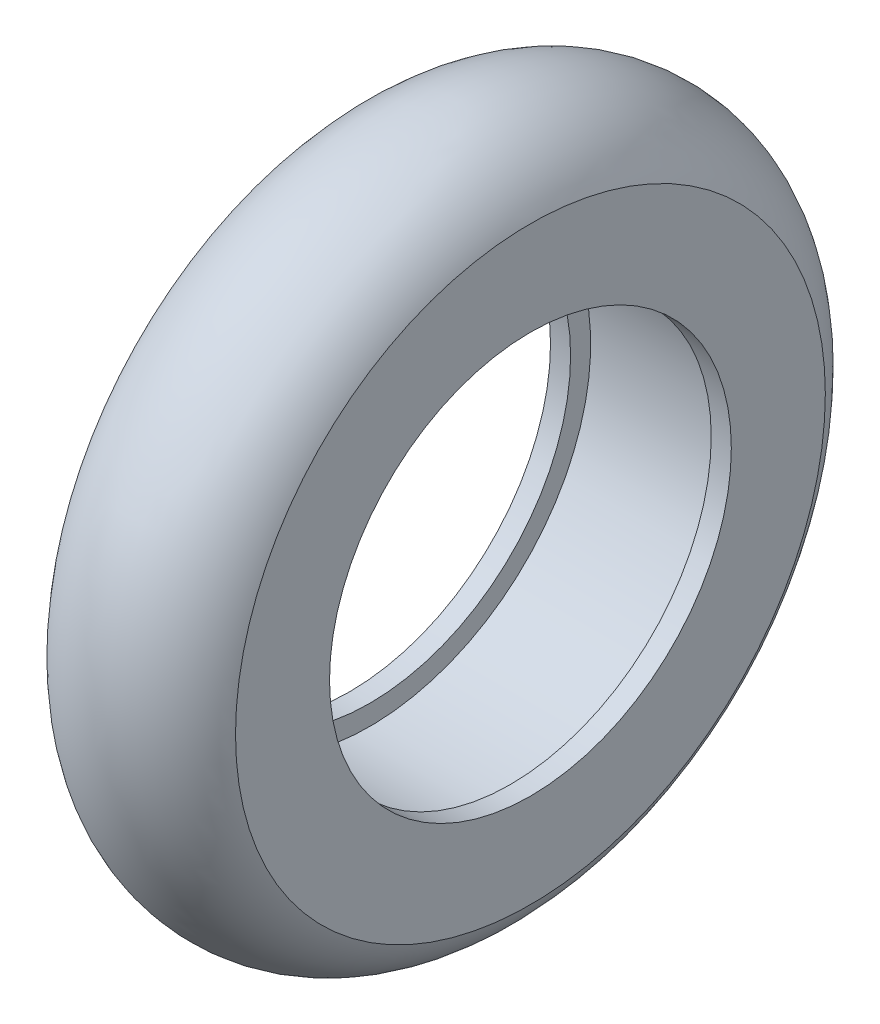
ISO-10303-21;
HEADER;
FILE_DESCRIPTION(('STEP AP214'),'2;1');
FILE_NAME('part.step','',(''),(''),'','','');
FILE_SCHEMA(('AUTOMOTIVE_DESIGN { 1 0 10303 214 1 1 1 1 }'));
ENDSEC;
DATA;
#1=APPLICATION_CONTEXT('core data for automotive mechanical design processes');
#2=APPLICATION_PROTOCOL_DEFINITION('international standard','automotive_design',2000,#1);
#3=PRODUCT_CONTEXT('',#1,'mechanical');
#4=PRODUCT('Part','Part','',(#3));
#5=PRODUCT_RELATED_PRODUCT_CATEGORY('part','',(#4));
#6=PRODUCT_DEFINITION_FORMATION('','',#4);
#7=PRODUCT_DEFINITION_CONTEXT('part definition',#1,'design');
#8=PRODUCT_DEFINITION('design','',#6,#7);
#9=PRODUCT_DEFINITION_SHAPE('','',#8);
#10=(LENGTH_UNIT() NAMED_UNIT(*) SI_UNIT(.MILLI.,.METRE.));
#11=(NAMED_UNIT(*) PLANE_ANGLE_UNIT() SI_UNIT($,.RADIAN.));
#12=(NAMED_UNIT(*) SI_UNIT($,.STERADIAN.) SOLID_ANGLE_UNIT());
#13=UNCERTAINTY_MEASURE_WITH_UNIT(LENGTH_MEASURE(1.E-05),#10,'distance_accuracy_value','');
#14=(GEOMETRIC_REPRESENTATION_CONTEXT(3) GLOBAL_UNCERTAINTY_ASSIGNED_CONTEXT((#13)) GLOBAL_UNIT_ASSIGNED_CONTEXT((#10,
#11,#12)) REPRESENTATION_CONTEXT('',''));
#15=CARTESIAN_POINT('',(0.,0.,0.));
#16=DIRECTION('',(0.,0.,1.));
#17=DIRECTION('',(1.,0.,0.));
#18=AXIS2_PLACEMENT_3D('',#15,#16,#17);
#19=CARTESIAN_POINT('',(-8.,11.,0.));
#20=DIRECTION('',(-1.,0.,0.));
#21=DIRECTION('',(0.,0.,1.));
#22=AXIS2_PLACEMENT_3D('',#19,#20,#21);
#23=PLANE('',#22);
#24=CARTESIAN_POINT('',(-8.,0.,0.));
#25=DIRECTION('',(-1.,0.,0.));
#26=DIRECTION('',(0.,0.,1.));
#27=AXIS2_PLACEMENT_3D('',#24,#25,#26);
#28=CIRCLE('',#27,11.);
#29=CARTESIAN_POINT('',(-8.,0.,11.));
#30=VERTEX_POINT('',#29);
#31=EDGE_CURVE('E10',#30,#30,#28,.T.);
#32=ORIENTED_EDGE('',*,*,#31,.F.);
#33=EDGE_LOOP('',(#32));
#34=FACE_BOUND('',#33,.T.);
#35=CARTESIAN_POINT('',(-8.,0.,0.));
#36=DIRECTION('',(-1.,0.,0.));
#37=DIRECTION('',(0.,0.,1.));
#38=AXIS2_PLACEMENT_3D('',#35,#36,#37);
#39=CIRCLE('',#38,10.);
#40=CARTESIAN_POINT('',(-8.,0.,10.));
#41=VERTEX_POINT('',#40);
#42=EDGE_CURVE('E71',#41,#41,#39,.T.);
#43=ORIENTED_EDGE('',*,*,#42,.T.);
#44=EDGE_LOOP('',(#43));
#45=FACE_BOUND('',#44,.T.);
#46=ADVANCED_FACE('F43',(#34,#45),#23,.F.);
#47=CARTESIAN_POINT('',(-9.,0.,0.));
#48=DIRECTION('',(-1.,0.,0.));
#49=DIRECTION('',(0.,0.,1.));
#50=AXIS2_PLACEMENT_3D('',#47,#48,#49);
#51=CYLINDRICAL_SURFACE('',#50,11.);
#52=CARTESIAN_POINT('',(-0.999999999999999,0.,0.));
#53=DIRECTION('',(-1.,0.,0.));
#54=DIRECTION('',(0.,0.,1.));
#55=AXIS2_PLACEMENT_3D('',#52,#53,#54);
#56=CIRCLE('',#55,11.);
#57=CARTESIAN_POINT('',(-0.999999999999999,0.,11.));
#58=VERTEX_POINT('',#57);
#59=EDGE_CURVE('E49',#58,#58,#56,.T.);
#60=ORIENTED_EDGE('',*,*,#59,.F.);
#61=EDGE_LOOP('',(#60));
#62=FACE_BOUND('',#61,.T.);
#63=ORIENTED_EDGE('',*,*,#31,.T.);
#64=EDGE_LOOP('',(#63));
#65=FACE_BOUND('',#64,.T.);
#66=ADVANCED_FACE('F108',(#62,#65),#51,.F.);
#67=CARTESIAN_POINT('',(-1.,10.,0.));
#68=DIRECTION('',(1.,0.,0.));
#69=DIRECTION('',(0.,0.,-1.));
#70=AXIS2_PLACEMENT_3D('',#67,#68,#69);
#71=PLANE('',#70);
#72=CARTESIAN_POINT('',(-0.999999999999999,0.,0.));
#73=DIRECTION('',(-1.,0.,0.));
#74=DIRECTION('',(0.,0.,1.));
#75=AXIS2_PLACEMENT_3D('',#72,#73,#74);
#76=CIRCLE('',#75,10.);
#77=CARTESIAN_POINT('',(-0.999999999999999,0.,10.));
#78=VERTEX_POINT('',#77);
#79=EDGE_CURVE('E53',#78,#78,#76,.T.);
#80=ORIENTED_EDGE('',*,*,#79,.F.);
#81=EDGE_LOOP('',(#80));
#82=FACE_BOUND('',#81,.T.);
#83=ORIENTED_EDGE('',*,*,#59,.T.);
#84=EDGE_LOOP('',(#83));
#85=FACE_BOUND('',#84,.T.);
#86=ADVANCED_FACE('F103',(#82,#85),#71,.F.);
#87=CARTESIAN_POINT('',(-9.,0.,0.));
#88=DIRECTION('',(-1.,0.,0.));
#89=DIRECTION('',(0.,0.,1.));
#90=AXIS2_PLACEMENT_3D('',#87,#88,#89);
#91=CYLINDRICAL_SURFACE('',#90,10.);
#92=CARTESIAN_POINT('',(0.,0.,0.));
#93=DIRECTION('',(-1.,0.,0.));
#94=DIRECTION('',(0.,0.,1.));
#95=AXIS2_PLACEMENT_3D('',#92,#93,#94);
#96=CIRCLE('',#95,10.);
#97=CARTESIAN_POINT('',(0.,0.,10.));
#98=VERTEX_POINT('',#97);
#99=EDGE_CURVE('E57',#98,#98,#96,.T.);
#100=ORIENTED_EDGE('',*,*,#99,.F.);
#101=EDGE_LOOP('',(#100));
#102=FACE_BOUND('',#101,.T.);
#103=ORIENTED_EDGE('',*,*,#79,.T.);
#104=EDGE_LOOP('',(#103));
#105=FACE_BOUND('',#104,.T.);
#106=ADVANCED_FACE('F97',(#102,#105),#91,.F.);
#107=CARTESIAN_POINT('',(0.,14.6794494717703,0.));
#108=DIRECTION('',(-1.,0.,0.));
#109=DIRECTION('',(0.,0.,1.));
#110=AXIS2_PLACEMENT_3D('',#107,#108,#109);
#111=PLANE('',#110);
#112=CARTESIAN_POINT('',(0.,0.,0.));
#113=DIRECTION('',(-1.,0.,0.));
#114=DIRECTION('',(0.,0.,1.));
#115=AXIS2_PLACEMENT_3D('',#112,#113,#114);
#116=CIRCLE('',#115,14.6794494717703);
#117=CARTESIAN_POINT('',(0.,0.,14.6794494717703));
#118=VERTEX_POINT('',#117);
#119=EDGE_CURVE('E62',#118,#118,#116,.T.);
#120=ORIENTED_EDGE('',*,*,#119,.F.);
#121=EDGE_LOOP('',(#120));
#122=FACE_BOUND('',#121,.T.);
#123=ORIENTED_EDGE('',*,*,#99,.T.);
#124=EDGE_LOOP('',(#123));
#125=FACE_BOUND('',#124,.T.);
#126=ADVANCED_FACE('F91',(#122,#125),#111,.F.);
#127=CARTESIAN_POINT('',(-4.5,0.,0.));
#128=DIRECTION('',(-1.,0.,0.));
#129=DIRECTION('',(0.,0.,1.));
#130=AXIS2_PLACEMENT_3D('',#127,#128,#129);
#131=TOROIDAL_SURFACE('',#130,12.5,5.);
#132=CARTESIAN_POINT('',(-9.,0.,0.));
#133=DIRECTION('',(-1.,0.,0.));
#134=DIRECTION('',(0.,0.,1.));
#135=AXIS2_PLACEMENT_3D('',#132,#133,#134);
#136=CIRCLE('',#135,14.6794494717703);
#137=CARTESIAN_POINT('',(-9.,0.,14.6794494717703));
#138=VERTEX_POINT('',#137);
#139=EDGE_CURVE('E65',#138,#138,#136,.T.);
#140=ORIENTED_EDGE('',*,*,#139,.F.);
#141=EDGE_LOOP('',(#140));
#142=FACE_BOUND('',#141,.T.);
#143=ORIENTED_EDGE('',*,*,#119,.T.);
#144=EDGE_LOOP('',(#143));
#145=FACE_BOUND('',#144,.T.);
#146=ADVANCED_FACE('F85',(#142,#145),#131,.T.);
#147=CARTESIAN_POINT('',(-9.,10.,0.));
#148=DIRECTION('',(1.,0.,0.));
#149=DIRECTION('',(0.,0.,-1.));
#150=AXIS2_PLACEMENT_3D('',#147,#148,#149);
#151=PLANE('',#150);
#152=CARTESIAN_POINT('',(-9.,0.,0.));
#153=DIRECTION('',(-1.,0.,0.));
#154=DIRECTION('',(0.,0.,1.));
#155=AXIS2_PLACEMENT_3D('',#152,#153,#154);
#156=CIRCLE('',#155,10.);
#157=CARTESIAN_POINT('',(-9.,0.,10.));
#158=VERTEX_POINT('',#157);
#159=EDGE_CURVE('E68',#158,#158,#156,.T.);
#160=ORIENTED_EDGE('',*,*,#159,.F.);
#161=EDGE_LOOP('',(#160));
#162=FACE_BOUND('',#161,.T.);
#163=ORIENTED_EDGE('',*,*,#139,.T.);
#164=EDGE_LOOP('',(#163));
#165=FACE_BOUND('',#164,.T.);
#166=ADVANCED_FACE('F79',(#162,#165),#151,.F.);
#167=CARTESIAN_POINT('',(-9.,0.,0.));
#168=DIRECTION('',(-1.,0.,0.));
#169=DIRECTION('',(0.,0.,1.));
#170=AXIS2_PLACEMENT_3D('',#167,#168,#169);
#171=CYLINDRICAL_SURFACE('',#170,10.);
#172=ORIENTED_EDGE('',*,*,#42,.F.);
#173=EDGE_LOOP('',(#172));
#174=FACE_BOUND('',#173,.T.);
#175=ORIENTED_EDGE('',*,*,#159,.T.);
#176=EDGE_LOOP('',(#175));
#177=FACE_BOUND('',#176,.T.);
#178=ADVANCED_FACE('F76',(#174,#177),#171,.F.);
#179=CLOSED_SHELL('',(#46,#66,#86,#106,#126,#146,#166,#178));
#180=MANIFOLD_SOLID_BREP('B2',#179);
#181=ADVANCED_BREP_SHAPE_REPRESENTATION('',(#18,#180),#14);
#182=SHAPE_DEFINITION_REPRESENTATION(#9,#181);
ENDSEC;
END-ISO-10303-21;
